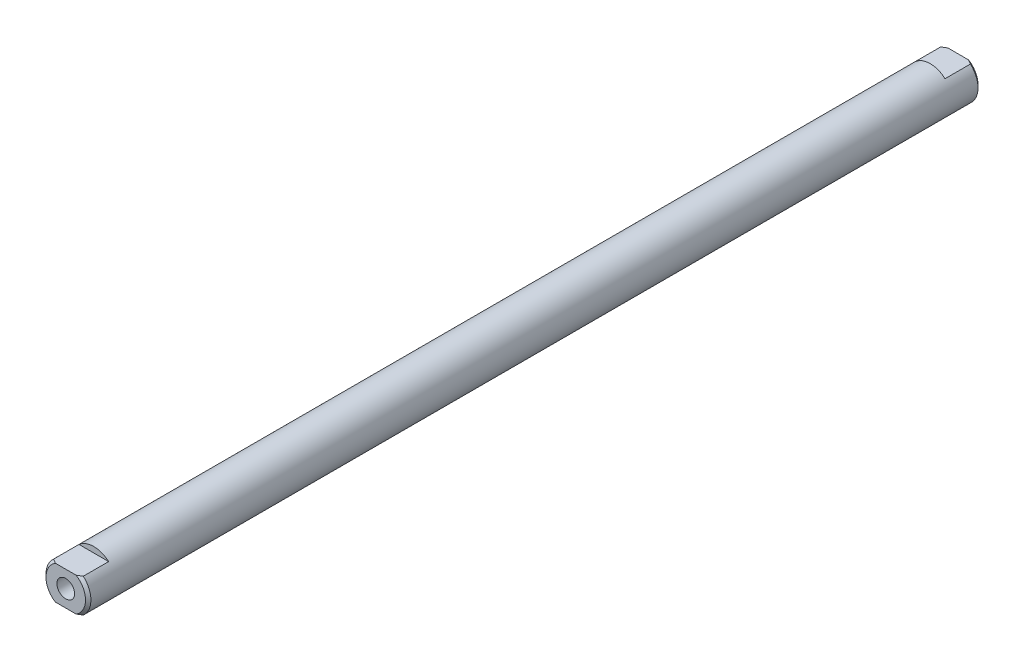
ISO-10303-21;
HEADER;
FILE_DESCRIPTION(('STEP AP214'),'2;1');
FILE_NAME('part.step','',(''),(''),'','','');
FILE_SCHEMA(('AUTOMOTIVE_DESIGN { 1 0 10303 214 1 1 1 1 }'));
ENDSEC;
DATA;
#1=APPLICATION_CONTEXT('core data for automotive mechanical design processes');
#2=APPLICATION_PROTOCOL_DEFINITION('international standard','automotive_design',2000,#1);
#3=PRODUCT_CONTEXT('',#1,'mechanical');
#4=PRODUCT('Part','Part','',(#3));
#5=PRODUCT_RELATED_PRODUCT_CATEGORY('part','',(#4));
#6=PRODUCT_DEFINITION_FORMATION('','',#4);
#7=PRODUCT_DEFINITION_CONTEXT('part definition',#1,'design');
#8=PRODUCT_DEFINITION('design','',#6,#7);
#9=PRODUCT_DEFINITION_SHAPE('','',#8);
#10=(LENGTH_UNIT() NAMED_UNIT(*) SI_UNIT(.MILLI.,.METRE.));
#11=(NAMED_UNIT(*) PLANE_ANGLE_UNIT() SI_UNIT($,.RADIAN.));
#12=(NAMED_UNIT(*) SI_UNIT($,.STERADIAN.) SOLID_ANGLE_UNIT());
#13=UNCERTAINTY_MEASURE_WITH_UNIT(LENGTH_MEASURE(1.E-05),#10,'distance_accuracy_value','');
#14=(GEOMETRIC_REPRESENTATION_CONTEXT(3) GLOBAL_UNCERTAINTY_ASSIGNED_CONTEXT((#13)) GLOBAL_UNIT_ASSIGNED_CONTEXT((#10,
#11,#12)) REPRESENTATION_CONTEXT('',''));
#15=CARTESIAN_POINT('',(0.,0.,0.));
#16=DIRECTION('',(0.,0.,1.));
#17=DIRECTION('',(1.,0.,0.));
#18=AXIS2_PLACEMENT_3D('',#15,#16,#17);
#19=CARTESIAN_POINT('',(0.,0.,63.1189999999998));
#20=DIRECTION('',(0.,0.,-1.));
#21=DIRECTION('',(-1.,0.,0.));
#22=AXIS2_PLACEMENT_3D('',#19,#20,#21);
#23=CYLINDRICAL_SURFACE('',#22,3.175);
#24=CARTESIAN_POINT('',(0.,0.,62.7379999999998));
#25=DIRECTION('',(0.,0.,1.));
#26=DIRECTION('',(1.,0.,0.));
#27=AXIS2_PLACEMENT_3D('',#24,#25,#26);
#28=CIRCLE('',#27,3.175);
#29=CARTESIAN_POINT('',(-2.10006510315752,-2.38125,62.7379999999998));
#30=VERTEX_POINT('',#29);
#31=CARTESIAN_POINT('',(-2.10006510315752,2.38125,62.7379999999998));
#32=VERTEX_POINT('',#31);
#33=EDGE_CURVE('E264',#30,#32,#28,.F.);
#34=ORIENTED_EDGE('',*,*,#33,.T.);
#35=DIRECTION('',(0.,0.,1.));
#36=VECTOR('',#35,1.);
#37=CARTESIAN_POINT('',(-2.10006510315752,2.38125,59.15025));
#38=LINE('',#37,#36);
#39=CARTESIAN_POINT('',(-2.10006510315752,2.38125,59.15025));
#40=VERTEX_POINT('',#39);
#41=EDGE_CURVE('E219',#40,#32,#38,.T.);
#42=ORIENTED_EDGE('',*,*,#41,.F.);
#43=CARTESIAN_POINT('',(0.,0.,59.15025));
#44=DIRECTION('',(0.,0.,1.));
#45=DIRECTION('',(1.,0.,0.));
#46=AXIS2_PLACEMENT_3D('',#43,#44,#45);
#47=CIRCLE('',#46,3.175);
#48=CARTESIAN_POINT('',(2.10006510315749,2.38125,59.15025));
#49=VERTEX_POINT('',#48);
#50=EDGE_CURVE('E212',#49,#40,#47,.T.);
#51=ORIENTED_EDGE('',*,*,#50,.F.);
#52=DIRECTION('',(0.,0.,1.));
#53=VECTOR('',#52,1.);
#54=CARTESIAN_POINT('',(2.10006510315749,2.38125,59.15025));
#55=LINE('',#54,#53);
#56=CARTESIAN_POINT('',(2.10006510315752,2.38125,62.738));
#57=VERTEX_POINT('',#56);
#58=EDGE_CURVE('E222',#49,#57,#55,.T.);
#59=ORIENTED_EDGE('',*,*,#58,.T.);
#60=CARTESIAN_POINT('',(2.10006510315752,-2.38125,62.738));
#61=VERTEX_POINT('',#60);
#62=EDGE_CURVE('E263',#57,#61,#28,.F.);
#63=ORIENTED_EDGE('',*,*,#62,.T.);
#64=DIRECTION('',(0.,0.,1.));
#65=VECTOR('',#64,1.);
#66=CARTESIAN_POINT('',(2.10006510315749,-2.38125,59.15025));
#67=LINE('',#66,#65);
#68=CARTESIAN_POINT('',(2.10006510315749,-2.38125,59.15025));
#69=VERTEX_POINT('',#68);
#70=EDGE_CURVE('E236',#69,#61,#67,.T.);
#71=ORIENTED_EDGE('',*,*,#70,.F.);
#72=CARTESIAN_POINT('',(0.,0.,59.15025));
#73=DIRECTION('',(0.,0.,1.));
#74=DIRECTION('',(1.,0.,0.));
#75=AXIS2_PLACEMENT_3D('',#72,#73,#74);
#76=CIRCLE('',#75,3.175);
#77=CARTESIAN_POINT('',(-2.10006510315752,-2.38125,59.15025));
#78=VERTEX_POINT('',#77);
#79=EDGE_CURVE('E229',#78,#69,#76,.T.);
#80=ORIENTED_EDGE('',*,*,#79,.F.);
#81=DIRECTION('',(0.,0.,1.));
#82=VECTOR('',#81,1.);
#83=CARTESIAN_POINT('',(-2.10006510315752,-2.38125,59.15025));
#84=LINE('',#83,#82);
#85=EDGE_CURVE('E240',#78,#30,#84,.T.);
#86=ORIENTED_EDGE('',*,*,#85,.T.);
#87=EDGE_LOOP('',(#34,#42,#51,#59,#63,#71,#80,#86));
#88=FACE_BOUND('',#87,.T.);
#89=DIRECTION('',(0.,0.,-1.));
#90=VECTOR('',#89,1.);
#91=CARTESIAN_POINT('',(2.10006510315752,2.38125,-59.15025));
#92=LINE('',#91,#90);
#93=CARTESIAN_POINT('',(2.10006510315752,2.38125,-59.15025));
#94=VERTEX_POINT('',#93);
#95=CARTESIAN_POINT('',(2.10006510315752,2.38125,-62.738));
#96=VERTEX_POINT('',#95);
#97=EDGE_CURVE('E90',#94,#96,#92,.T.);
#98=ORIENTED_EDGE('',*,*,#97,.F.);
#99=CARTESIAN_POINT('',(0.,0.,-59.15025));
#100=DIRECTION('',(0.,0.,1.));
#101=DIRECTION('',(1.,0.,0.));
#102=AXIS2_PLACEMENT_3D('',#99,#100,#101);
#103=CIRCLE('',#102,3.175);
#104=CARTESIAN_POINT('',(-2.10006510315749,2.38125,-59.15025));
#105=VERTEX_POINT('',#104);
#106=EDGE_CURVE('E177',#94,#105,#103,.T.);
#107=ORIENTED_EDGE('',*,*,#106,.T.);
#108=DIRECTION('',(0.,0.,-1.));
#109=VECTOR('',#108,1.);
#110=CARTESIAN_POINT('',(-2.10006510315749,2.38125,-59.15025));
#111=LINE('',#110,#109);
#112=CARTESIAN_POINT('',(-2.10006510315752,2.38125,-62.7380000000002));
#113=VERTEX_POINT('',#112);
#114=EDGE_CURVE('E173',#105,#113,#111,.T.);
#115=ORIENTED_EDGE('',*,*,#114,.T.);
#116=CARTESIAN_POINT('',(0.,0.,-62.7380000000002));
#117=DIRECTION('',(0.,0.,1.));
#118=DIRECTION('',(1.,0.,0.));
#119=AXIS2_PLACEMENT_3D('',#116,#117,#118);
#120=CIRCLE('',#119,3.175);
#121=CARTESIAN_POINT('',(-2.10006510315752,-2.38125,-62.7380000000002));
#122=VERTEX_POINT('',#121);
#123=EDGE_CURVE('E98',#113,#122,#120,.T.);
#124=ORIENTED_EDGE('',*,*,#123,.T.);
#125=DIRECTION('',(0.,0.,-1.));
#126=VECTOR('',#125,1.);
#127=CARTESIAN_POINT('',(-2.10006510315749,-2.38125,-59.15025));
#128=LINE('',#127,#126);
#129=CARTESIAN_POINT('',(-2.10006510315749,-2.38125,-59.15025));
#130=VERTEX_POINT('',#129);
#131=EDGE_CURVE('E202',#130,#122,#128,.T.);
#132=ORIENTED_EDGE('',*,*,#131,.F.);
#133=CARTESIAN_POINT('',(0.,0.,-59.15025));
#134=DIRECTION('',(0.,0.,1.));
#135=DIRECTION('',(1.,0.,0.));
#136=AXIS2_PLACEMENT_3D('',#133,#134,#135);
#137=CIRCLE('',#136,3.175);
#138=CARTESIAN_POINT('',(2.10006510315752,-2.38125,-59.15025));
#139=VERTEX_POINT('',#138);
#140=EDGE_CURVE('E195',#130,#139,#137,.T.);
#141=ORIENTED_EDGE('',*,*,#140,.T.);
#142=DIRECTION('',(0.,0.,-1.));
#143=VECTOR('',#142,1.);
#144=CARTESIAN_POINT('',(2.10006510315752,-2.38125,-59.15025));
#145=LINE('',#144,#143);
#146=CARTESIAN_POINT('',(2.10006510315752,-2.38125,-62.738));
#147=VERTEX_POINT('',#146);
#148=EDGE_CURVE('E206',#139,#147,#145,.T.);
#149=ORIENTED_EDGE('',*,*,#148,.T.);
#150=EDGE_CURVE('E186',#147,#96,#120,.T.);
#151=ORIENTED_EDGE('',*,*,#150,.T.);
#152=EDGE_LOOP('',(#98,#107,#115,#124,#132,#141,#149,#151));
#153=FACE_BOUND('',#152,.T.);
#154=ADVANCED_FACE('F68',(#88,#153),#23,.T.);
#155=CARTESIAN_POINT('',(0.,0.,-63.1190000000002));
#156=DIRECTION('',(0.,0.,1.));
#157=DIRECTION('',(1.,0.,0.));
#158=AXIS2_PLACEMENT_3D('',#155,#156,#157);
#159=PLANE('',#158);
#160=CARTESIAN_POINT('',(0.,0.,-63.1190000000002));
#161=DIRECTION('',(0.,0.,-1.));
#162=DIRECTION('',(-1.,0.,0.));
#163=AXIS2_PLACEMENT_3D('',#160,#161,#162);
#164=CIRCLE('',#163,1.25);
#165=CARTESIAN_POINT('',(-1.25,0.,-63.1190000000002));
#166=VERTEX_POINT('',#165);
#167=EDGE_CURVE('E244',#166,#166,#164,.T.);
#168=ORIENTED_EDGE('',*,*,#167,.F.);
#169=EDGE_LOOP('',(#168));
#170=FACE_BOUND('',#169,.T.);
#171=DIRECTION('',(1.,0.,0.));
#172=VECTOR('',#171,1.);
#173=CARTESIAN_POINT('',(-2.10006510315752,2.38125,-63.1190000000002));
#174=LINE('',#173,#172);
#175=CARTESIAN_POINT('',(-1.46153495938356,2.38125,-63.119));
#176=VERTEX_POINT('',#175);
#177=CARTESIAN_POINT('',(1.46153495938353,2.38125,-63.1190000000002));
#178=VERTEX_POINT('',#177);
#179=EDGE_CURVE('E181',#176,#178,#174,.T.);
#180=ORIENTED_EDGE('',*,*,#179,.T.);
#181=CARTESIAN_POINT('',(0.,0.,-63.1190000000002));
#182=DIRECTION('',(0.,0.,1.));
#183=DIRECTION('',(1.,0.,0.));
#184=AXIS2_PLACEMENT_3D('',#181,#182,#183);
#185=CIRCLE('',#184,2.79400000000005);
#186=CARTESIAN_POINT('',(1.46153495938353,-2.38125,-63.1190000000002));
#187=VERTEX_POINT('',#186);
#188=EDGE_CURVE('E270',#178,#187,#185,.F.);
#189=ORIENTED_EDGE('',*,*,#188,.T.);
#190=DIRECTION('',(-1.,0.,0.));
#191=VECTOR('',#190,1.);
#192=CARTESIAN_POINT('',(-2.10006510315752,-2.38125,-63.1190000000002));
#193=LINE('',#192,#191);
#194=CARTESIAN_POINT('',(-1.46153495938356,-2.38125,-63.119));
#195=VERTEX_POINT('',#194);
#196=EDGE_CURVE('E191',#187,#195,#193,.T.);
#197=ORIENTED_EDGE('',*,*,#196,.T.);
#198=EDGE_CURVE('E271',#195,#176,#185,.F.);
#199=ORIENTED_EDGE('',*,*,#198,.T.);
#200=EDGE_LOOP('',(#180,#189,#197,#199));
#201=FACE_BOUND('',#200,.T.);
#202=ADVANCED_FACE('F323',(#170,#201),#159,.F.);
#203=CARTESIAN_POINT('',(0.,0.,-62.7380000000002));
#204=DIRECTION('',(0.,0.,1.));
#205=DIRECTION('',(1.,0.,0.));
#206=AXIS2_PLACEMENT_3D('',#203,#204,#205);
#207=CONICAL_SURFACE('',#206,3.175,0.785398163397434);
#208=ORIENTED_EDGE('',*,*,#123,.F.);
#209=CARTESIAN_POINT('',(-4.63069030655713,2.38125,-60.7059236343469));
#210=CARTESIAN_POINT('',(-4.49553132541923,2.38125,-60.8260802009953));
#211=CARTESIAN_POINT('',(-4.35986002924322,2.38125,-60.9456706732622));
#212=CARTESIAN_POINT('',(-4.08708322844067,2.38125,-61.1833062493008));
#213=CARTESIAN_POINT('',(-3.94997720798199,2.38125,-61.3013507603202));
#214=CARTESIAN_POINT('',(-3.67217163035429,2.38125,-61.5369599536313));
#215=CARTESIAN_POINT('',(-3.53144853919789,2.38125,-61.654496981364));
#216=CARTESIAN_POINT('',(-3.24768706853622,2.38125,-61.8866924696677));
#217=CARTESIAN_POINT('',(-3.10464917563215,2.38125,-62.0013515226236));
#218=CARTESIAN_POINT('',(-2.82237006719178,2.38125,-62.2212975355829));
#219=CARTESIAN_POINT('',(-2.68327467679591,2.38125,-62.3267704253589));
#220=CARTESIAN_POINT('',(-2.40122217082611,2.38125,-62.5326296564435));
#221=CARTESIAN_POINT('',(-2.25826281977336,2.38125,-62.6330129522498));
#222=CARTESIAN_POINT('',(-1.96768401141083,2.38125,-62.8258814930042));
#223=CARTESIAN_POINT('',(-1.82008156284776,2.38125,-62.9183918032902));
#224=CARTESIAN_POINT('',(-1.59368372076468,2.38125,-63.0483174708263));
#225=CARTESIAN_POINT('',(-1.51742124142334,2.38125,-63.0901357090171));
#226=CARTESIAN_POINT('',(-1.36298358415602,2.38125,-63.1700635207539));
#227=CARTESIAN_POINT('',(-1.28480890231799,2.38125,-63.2081740436963));
#228=CARTESIAN_POINT('',(-1.13199175234926,2.38125,-63.2771981324037));
#229=CARTESIAN_POINT('',(-1.05749465811314,2.38125,-63.3084310539398));
#230=CARTESIAN_POINT('',(-0.906596735247549,2.38125,-63.3659613085553));
#231=CARTESIAN_POINT('',(-0.830195918678336,2.38125,-63.3922586728929));
#232=CARTESIAN_POINT('',(-0.675945963024341,2.38125,-63.4387568995347));
#233=CARTESIAN_POINT('',(-0.598105806977981,2.38125,-63.458987141031));
#234=CARTESIAN_POINT('',(-0.44094748493314,2.38125,-63.4924833445705));
#235=CARTESIAN_POINT('',(-0.36162990404152,2.38125,-63.50575200535));
#236=CARTESIAN_POINT('',(-0.200925088571876,2.38125,-63.524638200055));
#237=CARTESIAN_POINT('',(-0.119524462556586,2.38125,-63.5301442365351));
#238=CARTESIAN_POINT('',(0.0434084675828334,2.38125,-63.532747545654));
#239=CARTESIAN_POINT('',(0.124940763429008,2.38125,-63.529845327804));
#240=CARTESIAN_POINT('',(0.28752077391249,2.38125,-63.5158272054528));
#241=CARTESIAN_POINT('',(0.368566397601152,2.38125,-63.5046875058689));
#242=CARTESIAN_POINT('',(0.529263076350651,2.38125,-63.4749216712116));
#243=CARTESIAN_POINT('',(0.608913745946246,2.38125,-63.4562934998901));
#244=CARTESIAN_POINT('',(0.794311402274726,2.38125,-63.4048574403568));
#245=CARTESIAN_POINT('',(0.89930806838019,2.38125,-63.3693641152492));
#246=CARTESIAN_POINT('',(1.10574712786033,2.38125,-63.2892717061474));
#247=CARTESIAN_POINT('',(1.20718725513968,2.38125,-63.2446669359187));
#248=CARTESIAN_POINT('',(1.40772823736113,2.38125,-63.1481766568237));
#249=CARTESIAN_POINT('',(1.50679631104038,2.38125,-63.0962239118045));
#250=CARTESIAN_POINT('',(1.70197643090104,2.38125,-62.9871609401806));
#251=CARTESIAN_POINT('',(1.79808938467376,2.38125,-62.9300523187205));
#252=CARTESIAN_POINT('',(2.02024430726583,2.38125,-62.7918159558169));
#253=CARTESIAN_POINT('',(2.14531628661747,2.38125,-62.7091382051138));
#254=CARTESIAN_POINT('',(2.39210762509974,2.38125,-62.5388969116827));
#255=CARTESIAN_POINT('',(2.51382592216204,2.38125,-62.4513318471748));
#256=CARTESIAN_POINT('',(2.75482691030065,2.38125,-62.2725481226097));
#257=CARTESIAN_POINT('',(2.87410556364759,2.38125,-62.1813240458171));
#258=CARTESIAN_POINT('',(3.11061617476925,2.38125,-61.9962577821305));
#259=CARTESIAN_POINT('',(3.22784801466158,2.38125,-61.9024154452461));
#260=CARTESIAN_POINT('',(3.45391519149801,2.38125,-61.7182600860776));
#261=CARTESIAN_POINT('',(3.56284224941696,2.38125,-61.6280593313478));
#262=CARTESIAN_POINT('',(3.77953187627936,2.38125,-61.4462628837331));
#263=CARTESIAN_POINT('',(3.88729439574386,2.38125,-61.3546671319729));
#264=CARTESIAN_POINT('',(4.1014485226961,2.38125,-61.1707189271549));
#265=CARTESIAN_POINT('',(4.20784381500104,2.38125,-61.0783707562176));
#266=CARTESIAN_POINT('',(4.41982941615555,2.38125,-60.8927750276245));
#267=CARTESIAN_POINT('',(4.52541980154188,2.38125,-60.7995275574402));
#268=CARTESIAN_POINT('',(4.63069030655711,2.38125,-60.705923634347));
#269=B_SPLINE_CURVE_WITH_KNOTS('',3,(#209,#210,#211,#212,#213,#214,#215,#216,#217,#218,#219,
#220,#221,#222,#223,#224,#225,#226,#227,#228,#229,#230,#231,#232,#233,#234,#235,#236,#237,#238,
#239,#240,#241,#242,#243,#244,#245,#246,#247,#248,#249,#250,#251,#252,#253,#254,#255,#256,#257,
#258,#259,#260,#261,#262,#263,#264,#265,#266,#267,#268),.UNSPECIFIED.,.F.,.F.,(4,2,2,2,2,2,2,2,
2,2,2,2,2,2,2,2,2,2,2,2,2,2,2,2,2,2,2,2,2,4),(0.,0.542548804678603,1.0852998775753,
1.63532810125873,2.18524216631142,2.70884321167491,3.23275395771042,3.7549289222966,
4.01577916496488,4.27656243763169,4.51875854623597,4.76095312089539,5.00195522837791,
5.24286383947633,5.48719863273219,5.73151862045716,5.97654713015796,6.22164231256394,
6.55355708637781,6.88567963658228,7.22106573798821,7.55634778358586,8.00595793076939,
8.4557088642458,8.90615213075197,9.35662125468305,9.78088482891005,10.2051663589438,
10.6278111729964,11.0504152844589),.UNSPECIFIED.);
#270=EDGE_CURVE('E12',#113,#176,#269,.T.);
#271=ORIENTED_EDGE('',*,*,#270,.T.);
#272=ORIENTED_EDGE('',*,*,#198,.F.);
#273=CARTESIAN_POINT('',(4.63069030655713,-2.38125,-60.705923634347));
#274=CARTESIAN_POINT('',(4.49553132541919,-2.38125,-60.8260802009954));
#275=CARTESIAN_POINT('',(4.35986002924317,-2.38125,-60.9456706732622));
#276=CARTESIAN_POINT('',(4.08708322844061,-2.38125,-61.1833062493008));
#277=CARTESIAN_POINT('',(3.94997720798193,-2.38125,-61.3013507603203));
#278=CARTESIAN_POINT('',(3.67217163035423,-2.38125,-61.5369599536313));
#279=CARTESIAN_POINT('',(3.53144853919782,-2.38125,-61.654496981364));
#280=CARTESIAN_POINT('',(3.24768706853616,-2.38125,-61.8866924696678));
#281=CARTESIAN_POINT('',(3.10464917563212,-2.38125,-62.0013515226237));
#282=CARTESIAN_POINT('',(2.82237006719176,-2.38125,-62.221297535583));
#283=CARTESIAN_POINT('',(2.68327467679586,-2.38125,-62.3267704253589));
#284=CARTESIAN_POINT('',(2.40122217082606,-2.38125,-62.5326296564435));
#285=CARTESIAN_POINT('',(2.25826281977332,-2.38125,-62.6330129522498));
#286=CARTESIAN_POINT('',(1.9676840114108,-2.38125,-62.8258814930042));
#287=CARTESIAN_POINT('',(1.82008156284773,-2.38125,-62.9183918032902));
#288=CARTESIAN_POINT('',(1.59368372076466,-2.38125,-63.0483174708263));
#289=CARTESIAN_POINT('',(1.51742124142332,-2.38125,-63.0901357090171));
#290=CARTESIAN_POINT('',(1.36298358415601,-2.38125,-63.1700635207539));
#291=CARTESIAN_POINT('',(1.28480890231799,-2.38125,-63.2081740436963));
#292=CARTESIAN_POINT('',(1.13199175234925,-2.38125,-63.2771981324037));
#293=CARTESIAN_POINT('',(1.05749465811313,-2.38125,-63.3084310539398));
#294=CARTESIAN_POINT('',(0.906596735247536,-2.38125,-63.3659613085553));
#295=CARTESIAN_POINT('',(0.830195918678325,-2.38125,-63.3922586728929));
#296=CARTESIAN_POINT('',(0.675945963024329,-2.38125,-63.4387568995347));
#297=CARTESIAN_POINT('',(0.598105806977966,-2.38125,-63.4589871410311));
#298=CARTESIAN_POINT('',(0.440947484933119,-2.38125,-63.4924833445705));
#299=CARTESIAN_POINT('',(0.361629904041495,-2.38125,-63.50575200535));
#300=CARTESIAN_POINT('',(0.200925088571847,-2.38125,-63.524638200055));
#301=CARTESIAN_POINT('',(0.119524462556557,-2.38125,-63.5301442365351));
#302=CARTESIAN_POINT('',(-0.0434084675828622,-2.38125,-63.532747545654));
#303=CARTESIAN_POINT('',(-0.124940763429036,-2.38125,-63.5298453278039));
#304=CARTESIAN_POINT('',(-0.287520773912518,-2.38125,-63.5158272054527));
#305=CARTESIAN_POINT('',(-0.36856639760118,-2.38125,-63.5046875058689));
#306=CARTESIAN_POINT('',(-0.529263076350679,-2.38125,-63.4749216712116));
#307=CARTESIAN_POINT('',(-0.608913745946274,-2.38125,-63.4562934998901));
#308=CARTESIAN_POINT('',(-0.794311402274765,-2.38125,-63.4048574403568));
#309=CARTESIAN_POINT('',(-0.899308068380238,-2.38125,-63.3693641152492));
#310=CARTESIAN_POINT('',(-1.1057471278604,-2.38125,-63.2892717061473));
#311=CARTESIAN_POINT('',(-1.20718725513975,-2.38125,-63.2446669359187));
#312=CARTESIAN_POINT('',(-1.40772823736122,-2.38125,-63.1481766568237));
#313=CARTESIAN_POINT('',(-1.5067963110405,-2.38125,-63.0962239118044));
#314=CARTESIAN_POINT('',(-1.70197643090113,-2.38125,-62.9871609401805));
#315=CARTESIAN_POINT('',(-1.79808938467381,-2.38125,-62.9300523187203));
#316=CARTESIAN_POINT('',(-2.02024430726588,-2.38125,-62.7918159558167));
#317=CARTESIAN_POINT('',(-2.14531628661759,-2.38125,-62.7091382051136));
#318=CARTESIAN_POINT('',(-2.39210762509991,-2.38125,-62.5388969116827));
#319=CARTESIAN_POINT('',(-2.5138259221622,-2.38125,-62.4513318471747));
#320=CARTESIAN_POINT('',(-2.7548269103008,-2.38125,-62.2725481226095));
#321=CARTESIAN_POINT('',(-2.87410556364774,-2.38125,-62.1813240458169));
#322=CARTESIAN_POINT('',(-3.1106161747694,-2.38125,-61.9962577821304));
#323=CARTESIAN_POINT('',(-3.22784801466174,-2.38125,-61.902415445246));
#324=CARTESIAN_POINT('',(-3.45391519149815,-2.38125,-61.7182600860775));
#325=CARTESIAN_POINT('',(-3.56284224941709,-2.38125,-61.6280593313477));
#326=CARTESIAN_POINT('',(-3.77953187627947,-2.38125,-61.446262883733));
#327=CARTESIAN_POINT('',(-3.88729439574396,-2.38125,-61.3546671319728));
#328=CARTESIAN_POINT('',(-4.10144852269618,-2.38125,-61.1707189271548));
#329=CARTESIAN_POINT('',(-4.20784381500112,-2.38125,-61.0783707562175));
#330=CARTESIAN_POINT('',(-4.41982941615562,-2.38125,-60.8927750276245));
#331=CARTESIAN_POINT('',(-4.52541980154193,-2.38125,-60.7995275574402));
#332=CARTESIAN_POINT('',(-4.63069030655713,-2.38125,-60.7059236343469));
#333=B_SPLINE_CURVE_WITH_KNOTS('',3,(#273,#274,#275,#276,#277,#278,#279,#280,#281,#282,#283,
#284,#285,#286,#287,#288,#289,#290,#291,#292,#293,#294,#295,#296,#297,#298,#299,#300,#301,#302,
#303,#304,#305,#306,#307,#308,#309,#310,#311,#312,#313,#314,#315,#316,#317,#318,#319,#320,#321,
#322,#323,#324,#325,#326,#327,#328,#329,#330,#331,#332),.UNSPECIFIED.,.F.,.F.,(4,2,2,2,2,2,2,2,
2,2,2,2,2,2,2,2,2,2,2,2,2,2,2,2,2,2,2,2,2,4),(0.,0.542548804678612,1.08529987757531,
1.63532810125874,2.18524216631144,2.7088432116749,3.23275395771041,3.75492892229657,
4.01577916496484,4.27656243763163,4.51875854623592,4.76095312089534,5.00195522837787,
5.2428638394763,5.48719863273216,5.73151862045713,5.97654713015792,6.2216423125639,
6.55355708637781,6.88567963658231,7.22106573798826,7.55634778358596,8.0059579307695,
8.45570886424593,8.9061521307521,9.35662125468318,9.78088482891014,10.2051663589438,
10.6278111729964,11.0504152844589),.UNSPECIFIED.);
#334=EDGE_CURVE('E335',#195,#122,#333,.T.);
#335=ORIENTED_EDGE('',*,*,#334,.T.);
#336=EDGE_LOOP('',(#208,#271,#272,#335));
#337=FACE_BOUND('',#336,.T.);
#338=ADVANCED_FACE('F326',(#337),#207,.T.);
#339=ORIENTED_EDGE('',*,*,#188,.F.);
#340=EDGE_CURVE('E73',#178,#96,#269,.T.);
#341=ORIENTED_EDGE('',*,*,#340,.T.);
#342=ORIENTED_EDGE('',*,*,#150,.F.);
#343=EDGE_CURVE('E343',#147,#187,#333,.T.);
#344=ORIENTED_EDGE('',*,*,#343,.T.);
#345=EDGE_LOOP('',(#339,#341,#342,#344));
#346=FACE_BOUND('',#345,.T.);
#347=ADVANCED_FACE('F332',(#346),#207,.T.);
#348=CARTESIAN_POINT('',(0.,0.,63.1189999999998));
#349=DIRECTION('',(0.,0.,-1.));
#350=DIRECTION('',(-1.,0.,0.));
#351=AXIS2_PLACEMENT_3D('',#348,#349,#350);
#352=CONICAL_SURFACE('',#351,2.79399999999999,0.785398163397452);
#353=CARTESIAN_POINT('',(-4.63069030655713,2.38125,60.7059236343471));
#354=CARTESIAN_POINT('',(-4.49553132541902,2.38125,60.8260802009953));
#355=CARTESIAN_POINT('',(-4.35986002924294,2.38125,60.9456706732621));
#356=CARTESIAN_POINT('',(-4.08708322844034,2.38125,61.1833062493006));
#357=CARTESIAN_POINT('',(-3.94997720798168,2.38125,61.3013507603202));
#358=CARTESIAN_POINT('',(-3.67217163035395,2.38125,61.5369599536312));
#359=CARTESIAN_POINT('',(-3.53144853919748,2.38125,61.6544969813638));
#360=CARTESIAN_POINT('',(-3.24768706853595,2.38125,61.8866924696677));
#361=CARTESIAN_POINT('',(-3.10464917563209,2.38125,62.0013515226238));
#362=CARTESIAN_POINT('',(-2.82237006719174,2.38125,62.2212975355831));
#363=CARTESIAN_POINT('',(-2.68327467679569,2.38125,62.3267704253588));
#364=CARTESIAN_POINT('',(-2.40122217082578,2.38125,62.5326296564432));
#365=CARTESIAN_POINT('',(-2.2582628197731,2.38125,62.6330129522495));
#366=CARTESIAN_POINT('',(-1.96768401141063,2.38125,62.8258814930039));
#367=CARTESIAN_POINT('',(-1.82008156284756,2.38125,62.9183918032899));
#368=CARTESIAN_POINT('',(-1.59368372076449,2.38125,63.0483174708259));
#369=CARTESIAN_POINT('',(-1.51742124142316,2.38125,63.0901357090167));
#370=CARTESIAN_POINT('',(-1.36298358415586,2.38125,63.1700635207535));
#371=CARTESIAN_POINT('',(-1.28480890231784,2.38125,63.2081740436959));
#372=CARTESIAN_POINT('',(-1.13199175234911,2.38125,63.2771981324033));
#373=CARTESIAN_POINT('',(-1.05749465811299,2.38125,63.3084310539395));
#374=CARTESIAN_POINT('',(-0.90659673524739,2.38125,63.3659613085549));
#375=CARTESIAN_POINT('',(-0.830195918678171,2.38125,63.3922586728925));
#376=CARTESIAN_POINT('',(-0.675945963024165,2.38125,63.4387568995343));
#377=CARTESIAN_POINT('',(-0.598105806977801,2.38125,63.4589871410306));
#378=CARTESIAN_POINT('',(-0.440947484932952,2.38125,63.4924833445701));
#379=CARTESIAN_POINT('',(-0.361629904041328,2.38125,63.5057520053496));
#380=CARTESIAN_POINT('',(-0.200925088571678,2.38125,63.5246382000545));
#381=CARTESIAN_POINT('',(-0.119524462556386,2.38125,63.5301442365346));
#382=CARTESIAN_POINT('',(0.0434084675830373,2.38125,63.5327475456536));
#383=CARTESIAN_POINT('',(0.124940763429214,2.38125,63.5298453278035));
#384=CARTESIAN_POINT('',(0.287520773912699,2.38125,63.5158272054523));
#385=CARTESIAN_POINT('',(0.368566397601363,2.38125,63.5046875058684));
#386=CARTESIAN_POINT('',(0.529263076350867,2.38125,63.4749216712111));
#387=CARTESIAN_POINT('',(0.608913745946466,2.38125,63.4562934998896));
#388=CARTESIAN_POINT('',(0.794311402274966,2.38125,63.4048574403563));
#389=CARTESIAN_POINT('',(0.899308068380444,2.38125,63.3693641152486));
#390=CARTESIAN_POINT('',(1.10574712786062,2.38125,63.2892717061468));
#391=CARTESIAN_POINT('',(1.20718725513998,2.38125,63.2446669359181));
#392=CARTESIAN_POINT('',(1.40772823736146,2.38125,63.1481766568231));
#393=CARTESIAN_POINT('',(1.50679631104073,2.38125,63.0962239118038));
#394=CARTESIAN_POINT('',(1.70197643090142,2.38125,62.9871609401799));
#395=CARTESIAN_POINT('',(1.79808938467416,2.38125,62.9300523187198));
#396=CARTESIAN_POINT('',(2.02024430726621,2.38125,62.7918159558162));
#397=CARTESIAN_POINT('',(2.14531628661782,2.38125,62.7091382051131));
#398=CARTESIAN_POINT('',(2.39210762510002,2.38125,62.5388969116821));
#399=CARTESIAN_POINT('',(2.5138259221623,2.38125,62.4513318471742));
#400=CARTESIAN_POINT('',(2.75482691030086,2.38125,62.2725481226091));
#401=CARTESIAN_POINT('',(2.87410556364777,2.38125,62.1813240458165));
#402=CARTESIAN_POINT('',(3.11061617476937,2.38125,61.99625778213));
#403=CARTESIAN_POINT('',(3.22784801466169,2.38125,61.9024154452456));
#404=CARTESIAN_POINT('',(3.45391519149806,2.38125,61.7182600860772));
#405=CARTESIAN_POINT('',(3.56284224941699,2.38125,61.6280593313474));
#406=CARTESIAN_POINT('',(3.77953187627935,2.38125,61.4462628837328));
#407=CARTESIAN_POINT('',(3.88729439574384,2.38125,61.3546671319726));
#408=CARTESIAN_POINT('',(4.10144852269602,2.38125,61.1707189271546));
#409=CARTESIAN_POINT('',(4.20784381500092,2.38125,61.0783707562173));
#410=CARTESIAN_POINT('',(4.41982941615543,2.38125,60.8927750276243));
#411=CARTESIAN_POINT('',(4.52541980154179,2.38125,60.7995275574401));
#412=CARTESIAN_POINT('',(4.63069030655713,2.38125,60.705923634347));
#413=B_SPLINE_CURVE_WITH_KNOTS('',3,(#353,#354,#355,#356,#357,#358,#359,#360,#361,#362,#363,
#364,#365,#366,#367,#368,#369,#370,#371,#372,#373,#374,#375,#376,#377,#378,#379,#380,#381,#382,
#383,#384,#385,#386,#387,#388,#389,#390,#391,#392,#393,#394,#395,#396,#397,#398,#399,#400,#401,
#402,#403,#404,#405,#406,#407,#408,#409,#410,#411,#412),.UNSPECIFIED.,.F.,.F.,(4,2,2,2,2,2,2,2,
2,2,2,2,2,2,2,2,2,2,2,2,2,2,2,2,2,2,2,2,2,4),(0.,0.542548804678609,1.08529987757533,
1.63532810125876,2.18524216631144,2.70884321167484,3.23275395771028,3.7549289222964,
4.01577916496464,4.27656243763142,4.51875854623571,4.76095312089514,5.00195522837767,
5.24286383947609,5.48719863273197,5.73151862045694,5.97654713015774,6.22164231256374,
6.55355708637767,6.8856796365822,7.22106573798819,7.55634778358591,8.00595793076934,
8.45570886424564,8.90615213075171,9.35662125468269,9.7808848289096,10.2051663589432,
10.6278111729957,11.0504152844582),.UNSPECIFIED.);
#414=CARTESIAN_POINT('',(-1.46153495938342,2.38125,63.119));
#415=VERTEX_POINT('',#414);
#416=EDGE_CURVE('E344',#32,#415,#413,.T.);
#417=ORIENTED_EDGE('',*,*,#416,.F.);
#418=ORIENTED_EDGE('',*,*,#33,.F.);
#419=CARTESIAN_POINT('',(4.63069030655713,-2.38125,60.705923634347));
#420=CARTESIAN_POINT('',(4.49553132541905,-2.38125,60.8260802009952));
#421=CARTESIAN_POINT('',(4.35986002924299,-2.38125,60.9456706732621));
#422=CARTESIAN_POINT('',(4.08708322844039,-2.38125,61.1833062493006));
#423=CARTESIAN_POINT('',(3.94997720798173,-2.38125,61.3013507603201));
#424=CARTESIAN_POINT('',(3.672171630354,-2.38125,61.5369599536311));
#425=CARTESIAN_POINT('',(3.53144853919755,-2.38125,61.6544969813638));
#426=CARTESIAN_POINT('',(3.24768706853599,-2.38125,61.8866924696676));
#427=CARTESIAN_POINT('',(3.10464917563209,-2.38125,62.0013515226237));
#428=CARTESIAN_POINT('',(2.82237006719173,-2.38125,62.221297535583));
#429=CARTESIAN_POINT('',(2.68327467679572,-2.38125,62.3267704253587));
#430=CARTESIAN_POINT('',(2.40122217082583,-2.38125,62.5326296564432));
#431=CARTESIAN_POINT('',(2.25826281977313,-2.38125,62.6330129522495));
#432=CARTESIAN_POINT('',(1.96768401141065,-2.38125,62.8258814930039));
#433=CARTESIAN_POINT('',(1.82008156284757,-2.38125,62.9183918032899));
#434=CARTESIAN_POINT('',(1.5936837207645,-2.38125,63.0483174708259));
#435=CARTESIAN_POINT('',(1.51742124142317,-2.38125,63.0901357090167));
#436=CARTESIAN_POINT('',(1.36298358415587,-2.38125,63.1700635207535));
#437=CARTESIAN_POINT('',(1.28480890231785,-2.38125,63.2081740436959));
#438=CARTESIAN_POINT('',(1.13199175234911,-2.38125,63.2771981324033));
#439=CARTESIAN_POINT('',(1.05749465811299,-2.38125,63.3084310539395));
#440=CARTESIAN_POINT('',(0.90659673524739,-2.38125,63.3659613085549));
#441=CARTESIAN_POINT('',(0.830195918678171,-2.38125,63.3922586728925));
#442=CARTESIAN_POINT('',(0.675945963024165,-2.38125,63.4387568995343));
#443=CARTESIAN_POINT('',(0.598105806977801,-2.38125,63.4589871410306));
#444=CARTESIAN_POINT('',(0.440947484932952,-2.38125,63.4924833445701));
#445=CARTESIAN_POINT('',(0.361629904041328,-2.38125,63.5057520053496));
#446=CARTESIAN_POINT('',(0.200925088571681,-2.38125,63.5246382000545));
#447=CARTESIAN_POINT('',(0.119524462556392,-2.38125,63.5301442365346));
#448=CARTESIAN_POINT('',(-0.0434084675830268,-2.38125,63.5327475456536));
#449=CARTESIAN_POINT('',(-0.1249407634292,-2.38125,63.5298453278035));
#450=CARTESIAN_POINT('',(-0.287520773912682,-2.38125,63.5158272054523));
#451=CARTESIAN_POINT('',(-0.368566397601345,-2.38125,63.5046875058684));
#452=CARTESIAN_POINT('',(-0.529263076350845,-2.38125,63.4749216712111));
#453=CARTESIAN_POINT('',(-0.608913745946441,-2.38125,63.4562934998896));
#454=CARTESIAN_POINT('',(-0.794311402274933,-2.38125,63.4048574403563));
#455=CARTESIAN_POINT('',(-0.899308068380406,-2.38125,63.3693641152487));
#456=CARTESIAN_POINT('',(-1.10574712786058,-2.38125,63.2892717061468));
#457=CARTESIAN_POINT('',(-1.20718725513995,-2.38125,63.2446669359181));
#458=CARTESIAN_POINT('',(-1.4077282373614,-2.38125,63.1481766568231));
#459=CARTESIAN_POINT('',(-1.50679631104065,-2.38125,63.0962239118038));
#460=CARTESIAN_POINT('',(-1.70197643090137,-2.38125,62.98716094018));
#461=CARTESIAN_POINT('',(-1.79808938467416,-2.38125,62.93005231872));
#462=CARTESIAN_POINT('',(-2.02024430726622,-2.38125,62.7918159558164));
#463=CARTESIAN_POINT('',(-2.14531628661774,-2.38125,62.7091382051132));
#464=CARTESIAN_POINT('',(-2.39210762509988,-2.38125,62.5388969116822));
#465=CARTESIAN_POINT('',(-2.51382592216218,-2.38125,62.4513318471742));
#466=CARTESIAN_POINT('',(-2.75482691030074,-2.38125,62.2725481226092));
#467=CARTESIAN_POINT('',(-2.87410556364765,-2.38125,62.1813240458166));
#468=CARTESIAN_POINT('',(-3.11061617476926,-2.38125,61.9962577821301));
#469=CARTESIAN_POINT('',(-3.22784801466157,-2.38125,61.9024154452457));
#470=CARTESIAN_POINT('',(-3.45391519149796,-2.38125,61.7182600860773));
#471=CARTESIAN_POINT('',(-3.56284224941689,-2.38125,61.6280593313475));
#472=CARTESIAN_POINT('',(-3.77953187627926,-2.38125,61.4462628837328));
#473=CARTESIAN_POINT('',(-3.88729439574376,-2.38125,61.3546671319726));
#474=CARTESIAN_POINT('',(-4.10144852269595,-2.38125,61.1707189271546));
#475=CARTESIAN_POINT('',(-4.20784381500086,-2.38125,61.0783707562173));
#476=CARTESIAN_POINT('',(-4.41982941615539,-2.38125,60.8927750276244));
#477=CARTESIAN_POINT('',(-4.52541980154176,-2.38125,60.7995275574402));
#478=CARTESIAN_POINT('',(-4.63069030655713,-2.38125,60.7059236343471));
#479=B_SPLINE_CURVE_WITH_KNOTS('',3,(#419,#420,#421,#422,#423,#424,#425,#426,#427,#428,#429,
#430,#431,#432,#433,#434,#435,#436,#437,#438,#439,#440,#441,#442,#443,#444,#445,#446,#447,#448,
#449,#450,#451,#452,#453,#454,#455,#456,#457,#458,#459,#460,#461,#462,#463,#464,#465,#466,#467,
#468,#469,#470,#471,#472,#473,#474,#475,#476,#477,#478),.UNSPECIFIED.,.F.,.F.,(4,2,2,2,2,2,2,2,
2,2,2,2,2,2,2,2,2,2,2,2,2,2,2,2,2,2,2,2,2,4),(0.,0.542548804678615,1.08529987757532,
1.63532810125875,2.18524216631144,2.70884321167485,3.23275395771032,3.75492892229646,
4.0157791649647,4.27656243763148,4.51875854623578,4.7609531208952,5.00195522837774,
5.24286383947616,5.48719863273202,5.73151862045699,5.97654713015778,6.22164231256377,
6.55355708637769,6.88567963658221,7.22106573798818,7.55634778358587,8.00595793076927,
8.45570886424556,8.90615213075163,9.35662125468261,9.78088482890955,10.2051663589432,
10.6278111729957,11.0504152844582),.UNSPECIFIED.);
#480=CARTESIAN_POINT('',(-1.46153495938342,-2.38125,63.119));
#481=VERTEX_POINT('',#480);
#482=EDGE_CURVE('E280',#481,#30,#479,.T.);
#483=ORIENTED_EDGE('',*,*,#482,.F.);
#484=CARTESIAN_POINT('',(0.,0.,63.1189999999998));
#485=DIRECTION('',(0.,0.,1.));
#486=DIRECTION('',(1.,0.,0.));
#487=AXIS2_PLACEMENT_3D('',#484,#485,#486);
#488=CIRCLE('',#487,2.79399999999999);
#489=EDGE_CURVE('E275',#415,#481,#488,.T.);
#490=ORIENTED_EDGE('',*,*,#489,.F.);
#491=EDGE_LOOP('',(#417,#418,#483,#490));
#492=FACE_BOUND('',#491,.T.);
#493=ADVANCED_FACE('F321',(#492),#352,.T.);
#494=CARTESIAN_POINT('',(0.,0.,63.1189999999998));
#495=DIRECTION('',(0.,0.,1.));
#496=DIRECTION('',(1.,0.,0.));
#497=AXIS2_PLACEMENT_3D('',#494,#495,#496);
#498=PLANE('',#497);
#499=DIRECTION('',(1.,0.,0.));
#500=VECTOR('',#499,1.);
#501=CARTESIAN_POINT('',(-2.10006510315752,2.38125,63.1189999999998));
#502=LINE('',#501,#500);
#503=CARTESIAN_POINT('',(1.46153495938345,2.38125,63.1189999999998));
#504=VERTEX_POINT('',#503);
#505=EDGE_CURVE('E209',#415,#504,#502,.T.);
#506=ORIENTED_EDGE('',*,*,#505,.F.);
#507=ORIENTED_EDGE('',*,*,#489,.T.);
#508=DIRECTION('',(-1.,0.,0.));
#509=VECTOR('',#508,1.);
#510=CARTESIAN_POINT('',(-2.10006510315752,-2.38125,63.1189999999998));
#511=LINE('',#510,#509);
#512=CARTESIAN_POINT('',(1.46153495938345,-2.38125,63.1189999999998));
#513=VERTEX_POINT('',#512);
#514=EDGE_CURVE('E226',#513,#481,#511,.T.);
#515=ORIENTED_EDGE('',*,*,#514,.F.);
#516=EDGE_CURVE('E276',#513,#504,#488,.T.);
#517=ORIENTED_EDGE('',*,*,#516,.T.);
#518=EDGE_LOOP('',(#506,#507,#515,#517));
#519=FACE_BOUND('',#518,.T.);
#520=CARTESIAN_POINT('',(0.,0.,63.1189999999998));
#521=DIRECTION('',(0.,0.,1.));
#522=DIRECTION('',(1.,0.,0.));
#523=AXIS2_PLACEMENT_3D('',#520,#521,#522);
#524=CIRCLE('',#523,1.25);
#525=CARTESIAN_POINT('',(1.25,0.,63.1189999999998));
#526=VERTEX_POINT('',#525);
#527=EDGE_CURVE('E255',#526,#526,#524,.T.);
#528=ORIENTED_EDGE('',*,*,#527,.F.);
#529=EDGE_LOOP('',(#528));
#530=FACE_BOUND('',#529,.T.);
#531=ADVANCED_FACE('F317',(#519,#530),#498,.T.);
#532=CARTESIAN_POINT('',(0.,0.,55.626));
#533=DIRECTION('',(0.,0.,1.));
#534=DIRECTION('',(1.,0.,0.));
#535=AXIS2_PLACEMENT_3D('',#532,#533,#534);
#536=CONICAL_SURFACE('',#535,1.25,1.02974425867665);
#537=CARTESIAN_POINT('',(0.,0.,54.8749242262155));
#538=VERTEX_POINT('',#537);
#539=VERTEX_LOOP('',#538);
#540=FACE_BOUND('',#539,.T.);
#541=CARTESIAN_POINT('',(0.,0.,55.626));
#542=DIRECTION('',(0.,0.,1.));
#543=DIRECTION('',(1.,0.,0.));
#544=AXIS2_PLACEMENT_3D('',#541,#542,#543);
#545=CIRCLE('',#544,1.25);
#546=CARTESIAN_POINT('',(1.25,0.,55.626));
#547=VERTEX_POINT('',#546);
#548=EDGE_CURVE('E259',#547,#547,#545,.T.);
#549=ORIENTED_EDGE('',*,*,#548,.T.);
#550=EDGE_LOOP('',(#549));
#551=FACE_BOUND('',#550,.T.);
#552=ADVANCED_FACE('F313',(#540,#551),#536,.F.);
#553=CARTESIAN_POINT('',(0.,0.,63.1189999999998));
#554=DIRECTION('',(0.,0.,1.));
#555=DIRECTION('',(1.,0.,0.));
#556=AXIS2_PLACEMENT_3D('',#553,#554,#555);
#557=CYLINDRICAL_SURFACE('',#556,1.25);
#558=ORIENTED_EDGE('',*,*,#548,.F.);
#559=EDGE_LOOP('',(#558));
#560=FACE_BOUND('',#559,.T.);
#561=ORIENTED_EDGE('',*,*,#527,.T.);
#562=EDGE_LOOP('',(#561));
#563=FACE_BOUND('',#562,.T.);
#564=ADVANCED_FACE('F310',(#560,#563),#557,.F.);
#565=EDGE_CURVE('E289',#504,#57,#413,.T.);
#566=ORIENTED_EDGE('',*,*,#565,.F.);
#567=ORIENTED_EDGE('',*,*,#516,.F.);
#568=EDGE_CURVE('E288',#61,#513,#479,.T.);
#569=ORIENTED_EDGE('',*,*,#568,.F.);
#570=ORIENTED_EDGE('',*,*,#62,.F.);
#571=EDGE_LOOP('',(#566,#567,#569,#570));
#572=FACE_BOUND('',#571,.T.);
#573=ADVANCED_FACE('F70',(#572),#352,.T.);
#574=CARTESIAN_POINT('',(0.,0.,-55.626));
#575=DIRECTION('',(0.,0.,-1.));
#576=DIRECTION('',(-1.,0.,0.));
#577=AXIS2_PLACEMENT_3D('',#574,#575,#576);
#578=CONICAL_SURFACE('',#577,1.25,1.02974425867665);
#579=CARTESIAN_POINT('',(0.,0.,-54.8749242262155));
#580=VERTEX_POINT('',#579);
#581=VERTEX_LOOP('',#580);
#582=FACE_BOUND('',#581,.T.);
#583=CARTESIAN_POINT('',(0.,0.,-55.626));
#584=DIRECTION('',(0.,0.,-1.));
#585=DIRECTION('',(-1.,0.,0.));
#586=AXIS2_PLACEMENT_3D('',#583,#584,#585);
#587=CIRCLE('',#586,1.25);
#588=CARTESIAN_POINT('',(-1.25,0.,-55.626));
#589=VERTEX_POINT('',#588);
#590=EDGE_CURVE('E251',#589,#589,#587,.T.);
#591=ORIENTED_EDGE('',*,*,#590,.T.);
#592=EDGE_LOOP('',(#591));
#593=FACE_BOUND('',#592,.T.);
#594=ADVANCED_FACE('F305',(#582,#593),#578,.F.);
#595=CARTESIAN_POINT('',(0.,0.,-63.1190000000002));
#596=DIRECTION('',(0.,0.,-1.));
#597=DIRECTION('',(-1.,0.,0.));
#598=AXIS2_PLACEMENT_3D('',#595,#596,#597);
#599=CYLINDRICAL_SURFACE('',#598,1.25);
#600=ORIENTED_EDGE('',*,*,#590,.F.);
#601=EDGE_LOOP('',(#600));
#602=FACE_BOUND('',#601,.T.);
#603=ORIENTED_EDGE('',*,*,#167,.T.);
#604=EDGE_LOOP('',(#603));
#605=FACE_BOUND('',#604,.T.);
#606=ADVANCED_FACE('F301',(#602,#605),#599,.F.);
#607=CARTESIAN_POINT('',(-2.10006510315752,-2.38125,59.15025));
#608=DIRECTION('',(0.,1.,0.));
#609=DIRECTION('',(0.,0.,1.));
#610=AXIS2_PLACEMENT_3D('',#607,#608,#609);
#611=PLANE('',#610);
#612=ORIENTED_EDGE('',*,*,#568,.T.);
#613=ORIENTED_EDGE('',*,*,#514,.T.);
#614=ORIENTED_EDGE('',*,*,#482,.T.);
#615=ORIENTED_EDGE('',*,*,#85,.F.);
#616=DIRECTION('',(-1.,0.,0.));
#617=VECTOR('',#616,1.);
#618=CARTESIAN_POINT('',(-2.10006510315752,-2.38125,59.15025));
#619=LINE('',#618,#617);
#620=EDGE_CURVE('E232',#69,#78,#619,.T.);
#621=ORIENTED_EDGE('',*,*,#620,.F.);
#622=ORIENTED_EDGE('',*,*,#70,.T.);
#623=EDGE_LOOP('',(#612,#613,#614,#615,#621,#622));
#624=FACE_BOUND('',#623,.T.);
#625=ADVANCED_FACE('F295',(#624),#611,.F.);
#626=CARTESIAN_POINT('',(0.,0.,59.15025));
#627=DIRECTION('',(0.,0.,1.));
#628=DIRECTION('',(1.,0.,0.));
#629=AXIS2_PLACEMENT_3D('',#626,#627,#628);
#630=PLANE('',#629);
#631=ORIENTED_EDGE('',*,*,#79,.T.);
#632=ORIENTED_EDGE('',*,*,#620,.T.);
#633=EDGE_LOOP('',(#631,#632));
#634=FACE_BOUND('',#633,.T.);
#635=ADVANCED_FACE('F300',(#634),#630,.T.);
#636=CARTESIAN_POINT('',(-2.10006510315752,2.38125,59.15025));
#637=DIRECTION('',(0.,-1.,0.));
#638=DIRECTION('',(0.,0.,-1.));
#639=AXIS2_PLACEMENT_3D('',#636,#637,#638);
#640=PLANE('',#639);
#641=ORIENTED_EDGE('',*,*,#416,.T.);
#642=ORIENTED_EDGE('',*,*,#505,.T.);
#643=ORIENTED_EDGE('',*,*,#565,.T.);
#644=ORIENTED_EDGE('',*,*,#58,.F.);
#645=DIRECTION('',(1.,0.,0.));
#646=VECTOR('',#645,1.);
#647=CARTESIAN_POINT('',(-2.10006510315752,2.38125,59.15025));
#648=LINE('',#647,#646);
#649=EDGE_CURVE('E215',#40,#49,#648,.T.);
#650=ORIENTED_EDGE('',*,*,#649,.F.);
#651=ORIENTED_EDGE('',*,*,#41,.T.);
#652=EDGE_LOOP('',(#641,#642,#643,#644,#650,#651));
#653=FACE_BOUND('',#652,.T.);
#654=ADVANCED_FACE('F354',(#653),#640,.F.);
#655=CARTESIAN_POINT('',(0.,0.,59.15025));
#656=DIRECTION('',(0.,0.,1.));
#657=DIRECTION('',(1.,0.,0.));
#658=AXIS2_PLACEMENT_3D('',#655,#656,#657);
#659=PLANE('',#658);
#660=ORIENTED_EDGE('',*,*,#50,.T.);
#661=ORIENTED_EDGE('',*,*,#649,.T.);
#662=EDGE_LOOP('',(#660,#661));
#663=FACE_BOUND('',#662,.T.);
#664=ADVANCED_FACE('F351',(#663),#659,.T.);
#665=CARTESIAN_POINT('',(-2.10006510315749,-2.38125,-59.15025));
#666=DIRECTION('',(0.,-1.,0.));
#667=DIRECTION('',(0.,0.,-1.));
#668=AXIS2_PLACEMENT_3D('',#665,#666,#667);
#669=PLANE('',#668);
#670=ORIENTED_EDGE('',*,*,#148,.F.);
#671=DIRECTION('',(-1.,0.,0.));
#672=VECTOR('',#671,1.);
#673=CARTESIAN_POINT('',(-2.10006510315749,-2.38125,-59.15025));
#674=LINE('',#673,#672);
#675=EDGE_CURVE('E199',#139,#130,#674,.T.);
#676=ORIENTED_EDGE('',*,*,#675,.T.);
#677=ORIENTED_EDGE('',*,*,#131,.T.);
#678=ORIENTED_EDGE('',*,*,#334,.F.);
#679=ORIENTED_EDGE('',*,*,#196,.F.);
#680=ORIENTED_EDGE('',*,*,#343,.F.);
#681=EDGE_LOOP('',(#670,#676,#677,#678,#679,#680));
#682=FACE_BOUND('',#681,.T.);
#683=ADVANCED_FACE('F345',(#682),#669,.T.);
#684=CARTESIAN_POINT('',(0.,0.,-59.15025));
#685=DIRECTION('',(0.,0.,-1.));
#686=DIRECTION('',(1.,0.,0.));
#687=AXIS2_PLACEMENT_3D('',#684,#685,#686);
#688=PLANE('',#687);
#689=ORIENTED_EDGE('',*,*,#140,.F.);
#690=ORIENTED_EDGE('',*,*,#675,.F.);
#691=EDGE_LOOP('',(#689,#690));
#692=FACE_BOUND('',#691,.T.);
#693=ADVANCED_FACE('F350',(#692),#688,.T.);
#694=CARTESIAN_POINT('',(-2.10006510315749,2.38125,-59.15025));
#695=DIRECTION('',(0.,1.,0.));
#696=DIRECTION('',(0.,0.,1.));
#697=AXIS2_PLACEMENT_3D('',#694,#695,#696);
#698=PLANE('',#697);
#699=ORIENTED_EDGE('',*,*,#114,.F.);
#700=DIRECTION('',(1.,0.,0.));
#701=VECTOR('',#700,1.);
#702=CARTESIAN_POINT('',(-2.10006510315749,2.38125,-59.15025));
#703=LINE('',#702,#701);
#704=EDGE_CURVE('E170',#105,#94,#703,.T.);
#705=ORIENTED_EDGE('',*,*,#704,.T.);
#706=ORIENTED_EDGE('',*,*,#97,.T.);
#707=ORIENTED_EDGE('',*,*,#340,.F.);
#708=ORIENTED_EDGE('',*,*,#179,.F.);
#709=ORIENTED_EDGE('',*,*,#270,.F.);
#710=EDGE_LOOP('',(#699,#705,#706,#707,#708,#709));
#711=FACE_BOUND('',#710,.T.);
#712=ADVANCED_FACE('F172',(#711),#698,.T.);
#713=CARTESIAN_POINT('',(0.,0.,-59.15025));
#714=DIRECTION('',(0.,0.,-1.));
#715=DIRECTION('',(1.,0.,0.));
#716=AXIS2_PLACEMENT_3D('',#713,#714,#715);
#717=PLANE('',#716);
#718=ORIENTED_EDGE('',*,*,#106,.F.);
#719=ORIENTED_EDGE('',*,*,#704,.F.);
#720=EDGE_LOOP('',(#718,#719));
#721=FACE_BOUND('',#720,.T.);
#722=ADVANCED_FACE('F179',(#721),#717,.T.);
#723=CLOSED_SHELL('',(#154,#202,#338,#347,#493,#531,#552,#564,#573,#594,#606,#625,#635,#654,
#664,#683,#693,#712,#722));
#724=MANIFOLD_SOLID_BREP('B2',#723);
#725=ADVANCED_BREP_SHAPE_REPRESENTATION('',(#18,#724),#14);
#726=SHAPE_DEFINITION_REPRESENTATION(#9,#725);
ENDSEC;
END-ISO-10303-21;
